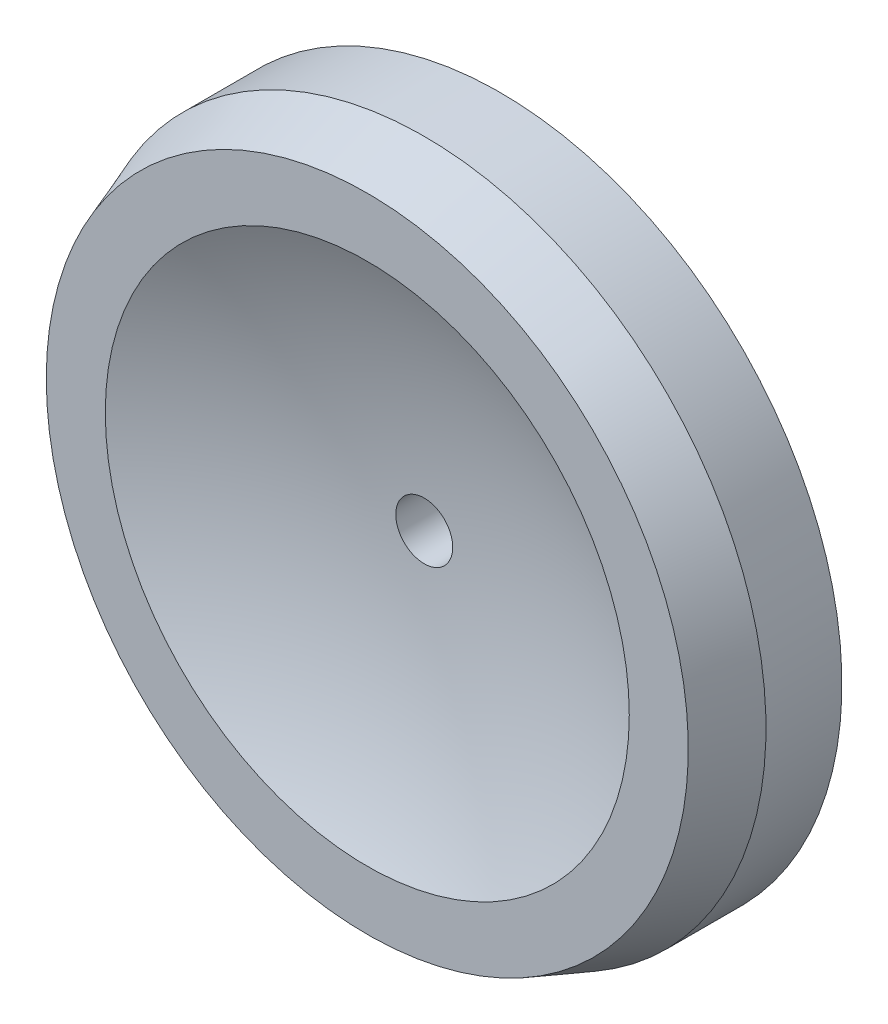
ISO-10303-21;
HEADER;
FILE_DESCRIPTION(('STEP AP214'),'2;1');
FILE_NAME('part.step','',(''),(''),'','','');
FILE_SCHEMA(('AUTOMOTIVE_DESIGN { 1 0 10303 214 1 1 1 1 }'));
ENDSEC;
DATA;
#1=APPLICATION_CONTEXT('core data for automotive mechanical design processes');
#2=APPLICATION_PROTOCOL_DEFINITION('international standard','automotive_design',2000,#1);
#3=PRODUCT_CONTEXT('',#1,'mechanical');
#4=PRODUCT('Part','Part','',(#3));
#5=PRODUCT_RELATED_PRODUCT_CATEGORY('part','',(#4));
#6=PRODUCT_DEFINITION_FORMATION('','',#4);
#7=PRODUCT_DEFINITION_CONTEXT('part definition',#1,'design');
#8=PRODUCT_DEFINITION('design','',#6,#7);
#9=PRODUCT_DEFINITION_SHAPE('','',#8);
#10=(LENGTH_UNIT() NAMED_UNIT(*) SI_UNIT(.MILLI.,.METRE.));
#11=(NAMED_UNIT(*) PLANE_ANGLE_UNIT() SI_UNIT($,.RADIAN.));
#12=(NAMED_UNIT(*) SI_UNIT($,.STERADIAN.) SOLID_ANGLE_UNIT());
#13=UNCERTAINTY_MEASURE_WITH_UNIT(LENGTH_MEASURE(1.E-05),#10,'distance_accuracy_value','');
#14=(GEOMETRIC_REPRESENTATION_CONTEXT(3) GLOBAL_UNCERTAINTY_ASSIGNED_CONTEXT((#13)) GLOBAL_UNIT_ASSIGNED_CONTEXT((#10,
#11,#12)) REPRESENTATION_CONTEXT('',''));
#15=CARTESIAN_POINT('',(0.,0.,0.));
#16=DIRECTION('',(0.,0.,1.));
#17=DIRECTION('',(1.,0.,0.));
#18=AXIS2_PLACEMENT_3D('',#15,#16,#17);
#19=CARTESIAN_POINT('',(4.69701770194955,-10.6460002522325,1.67));
#20=DIRECTION('',(0.,0.,-1.));
#21=DIRECTION('',(-1.,0.,0.));
#22=AXIS2_PLACEMENT_3D('',#19,#20,#21);
#23=CYLINDRICAL_SURFACE('',#22,0.9);
#24=CARTESIAN_POINT('',(4.69701770194955,-10.6460002522325,1.52));
#25=DIRECTION('',(0.,0.,-1.));
#26=DIRECTION('',(-1.,0.,0.));
#27=AXIS2_PLACEMENT_3D('',#24,#25,#26);
#28=CIRCLE('',#27,0.9);
#29=CARTESIAN_POINT('',(3.79701770194955,-10.6460002522325,1.52));
#30=VERTEX_POINT('',#29);
#31=EDGE_CURVE('E52',#30,#30,#28,.T.);
#32=ORIENTED_EDGE('',*,*,#31,.T.);
#33=EDGE_LOOP('',(#32));
#34=FACE_BOUND('',#33,.T.);
#35=CARTESIAN_POINT('',(4.69701770194955,-10.6460002522325,1.32));
#36=DIRECTION('',(0.,0.,-1.));
#37=DIRECTION('',(-1.,0.,0.));
#38=AXIS2_PLACEMENT_3D('',#35,#36,#37);
#39=CIRCLE('',#38,0.9);
#40=CARTESIAN_POINT('',(3.79701770194955,-10.6460002522325,1.32));
#41=VERTEX_POINT('',#40);
#42=EDGE_CURVE('E10',#41,#41,#39,.T.);
#43=ORIENTED_EDGE('',*,*,#42,.F.);
#44=EDGE_LOOP('',(#43));
#45=FACE_BOUND('',#44,.T.);
#46=ADVANCED_FACE('F30',(#34,#45),#23,.T.);
#47=CARTESIAN_POINT('',(4.77201770194955,-10.6460002522325,1.32));
#48=DIRECTION('',(0.,0.,-1.));
#49=DIRECTION('',(-1.,0.,0.));
#50=AXIS2_PLACEMENT_3D('',#47,#48,#49);
#51=PLANE('',#50);
#52=ORIENTED_EDGE('',*,*,#42,.T.);
#53=EDGE_LOOP('',(#52));
#54=FACE_BOUND('',#53,.T.);
#55=CARTESIAN_POINT('',(4.69701770194955,-10.6460002522325,1.32));
#56=DIRECTION('',(0.,0.,-1.));
#57=DIRECTION('',(-1.,0.,0.));
#58=AXIS2_PLACEMENT_3D('',#55,#56,#57);
#59=CIRCLE('',#58,0.0750000000000004);
#60=CARTESIAN_POINT('',(4.62201770194955,-10.6460002522325,1.32));
#61=VERTEX_POINT('',#60);
#62=EDGE_CURVE('E36',#61,#61,#59,.T.);
#63=ORIENTED_EDGE('',*,*,#62,.F.);
#64=EDGE_LOOP('',(#63));
#65=FACE_BOUND('',#64,.T.);
#66=ADVANCED_FACE('F70',(#54,#65),#51,.T.);
#67=CARTESIAN_POINT('',(4.69701770194955,-10.6460002522325,1.67));
#68=DIRECTION('',(0.,0.,-1.));
#69=DIRECTION('',(-1.,0.,0.));
#70=AXIS2_PLACEMENT_3D('',#67,#68,#69);
#71=CYLINDRICAL_SURFACE('',#70,0.0750000000000004);
#72=ORIENTED_EDGE('',*,*,#62,.T.);
#73=EDGE_LOOP('',(#72));
#74=FACE_BOUND('',#73,.T.);
#75=CARTESIAN_POINT('',(4.69701770194955,-10.6460002522325,1.52));
#76=DIRECTION('',(0.,0.,-1.));
#77=DIRECTION('',(-1.,0.,0.));
#78=AXIS2_PLACEMENT_3D('',#75,#76,#77);
#79=CIRCLE('',#78,0.0750000000000004);
#80=CARTESIAN_POINT('',(4.62201770194955,-10.6460002522325,1.52));
#81=VERTEX_POINT('',#80);
#82=EDGE_CURVE('E40',#81,#81,#79,.T.);
#83=ORIENTED_EDGE('',*,*,#82,.F.);
#84=EDGE_LOOP('',(#83));
#85=FACE_BOUND('',#84,.T.);
#86=ADVANCED_FACE('F74',(#74,#85),#71,.F.);
#87=CARTESIAN_POINT('',(4.69701770194955,-10.6460002522325,3.16325));
#88=DIRECTION('',(0.,0.,-1.));
#89=DIRECTION('',(1.,0.,0.));
#90=AXIS2_PLACEMENT_3D('',#87,#88,#89);
#91=SPHERICAL_SURFACE('',#90,1.64496065682435);
#92=ORIENTED_EDGE('',*,*,#82,.T.);
#93=EDGE_LOOP('',(#92));
#94=FACE_BOUND('',#93,.T.);
#95=CARTESIAN_POINT('',(4.69701770194955,-10.6460002522325,1.67));
#96=DIRECTION('',(0.,0.,-1.));
#97=DIRECTION('',(-1.,0.,0.));
#98=AXIS2_PLACEMENT_3D('',#95,#96,#97);
#99=CIRCLE('',#98,0.69);
#100=CARTESIAN_POINT('',(4.00701770194955,-10.6460002522325,1.67));
#101=VERTEX_POINT('',#100);
#102=EDGE_CURVE('E44',#101,#101,#99,.T.);
#103=ORIENTED_EDGE('',*,*,#102,.F.);
#104=EDGE_LOOP('',(#103));
#105=FACE_BOUND('',#104,.T.);
#106=ADVANCED_FACE('F66',(#94,#105),#91,.F.);
#107=CARTESIAN_POINT('',(5.54242216680962,-10.6460002522325,1.67));
#108=DIRECTION('',(0.,0.,1.));
#109=DIRECTION('',(1.,0.,0.));
#110=AXIS2_PLACEMENT_3D('',#107,#108,#109);
#111=PLANE('',#110);
#112=ORIENTED_EDGE('',*,*,#102,.T.);
#113=EDGE_LOOP('',(#112));
#114=FACE_BOUND('',#113,.T.);
#115=CARTESIAN_POINT('',(4.69701770194955,-10.6460002522325,1.67));
#116=DIRECTION('',(0.,0.,-1.));
#117=DIRECTION('',(-1.,0.,0.));
#118=AXIS2_PLACEMENT_3D('',#115,#116,#117);
#119=CIRCLE('',#118,0.845404464860069);
#120=CARTESIAN_POINT('',(3.85161323708948,-10.6460002522325,1.67));
#121=VERTEX_POINT('',#120);
#122=EDGE_CURVE('E49',#121,#121,#119,.T.);
#123=ORIENTED_EDGE('',*,*,#122,.F.);
#124=EDGE_LOOP('',(#123));
#125=FACE_BOUND('',#124,.T.);
#126=ADVANCED_FACE('F60',(#114,#125),#111,.T.);
#127=CARTESIAN_POINT('',(4.69701770194955,-10.6460002522325,1.52));
#128=DIRECTION('',(0.,0.,-1.));
#129=DIRECTION('',(-1.,0.,0.));
#130=AXIS2_PLACEMENT_3D('',#127,#128,#129);
#131=CONICAL_SURFACE('',#130,0.9,0.349065850398868);
#132=ORIENTED_EDGE('',*,*,#122,.T.);
#133=EDGE_LOOP('',(#132));
#134=FACE_BOUND('',#133,.T.);
#135=ORIENTED_EDGE('',*,*,#31,.F.);
#136=EDGE_LOOP('',(#135));
#137=FACE_BOUND('',#136,.T.);
#138=ADVANCED_FACE('F58',(#134,#137),#131,.T.);
#139=CLOSED_SHELL('',(#46,#66,#86,#106,#126,#138));
#140=MANIFOLD_SOLID_BREP('B2',#139);
#141=ADVANCED_BREP_SHAPE_REPRESENTATION('',(#18,#140),#14);
#142=SHAPE_DEFINITION_REPRESENTATION(#9,#141);
ENDSEC;
END-ISO-10303-21;
